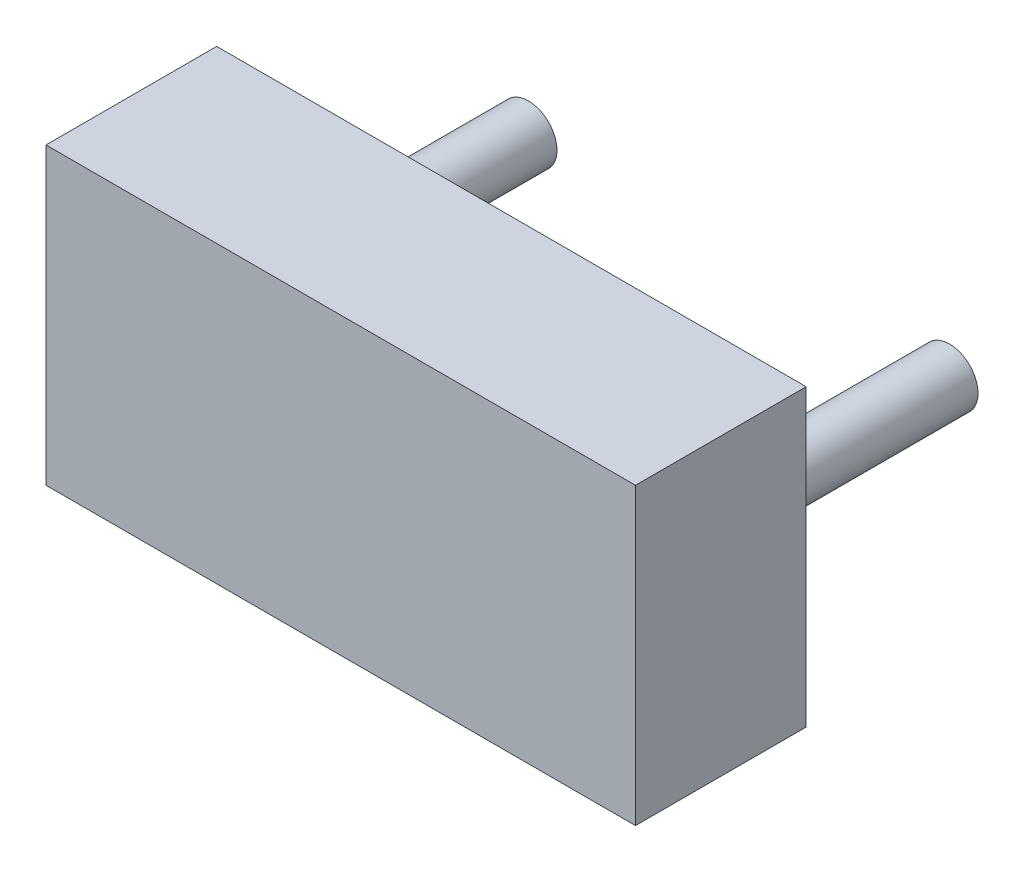
ISO-10303-21;
HEADER;
FILE_DESCRIPTION(('STEP AP214'),'2;1');
FILE_NAME('part.step','',(''),(''),'','','');
FILE_SCHEMA(('AUTOMOTIVE_DESIGN { 1 0 10303 214 1 1 1 1 }'));
ENDSEC;
DATA;
#1=APPLICATION_CONTEXT('core data for automotive mechanical design processes');
#2=APPLICATION_PROTOCOL_DEFINITION('international standard','automotive_design',2000,#1);
#3=PRODUCT_CONTEXT('',#1,'mechanical');
#4=PRODUCT('Part','Part','',(#3));
#5=PRODUCT_RELATED_PRODUCT_CATEGORY('part','',(#4));
#6=PRODUCT_DEFINITION_FORMATION('','',#4);
#7=PRODUCT_DEFINITION_CONTEXT('part definition',#1,'design');
#8=PRODUCT_DEFINITION('design','',#6,#7);
#9=PRODUCT_DEFINITION_SHAPE('','',#8);
#10=(LENGTH_UNIT() NAMED_UNIT(*) SI_UNIT(.MILLI.,.METRE.));
#11=(NAMED_UNIT(*) PLANE_ANGLE_UNIT() SI_UNIT($,.RADIAN.));
#12=(NAMED_UNIT(*) SI_UNIT($,.STERADIAN.) SOLID_ANGLE_UNIT());
#13=UNCERTAINTY_MEASURE_WITH_UNIT(LENGTH_MEASURE(1.E-05),#10,'distance_accuracy_value','');
#14=(GEOMETRIC_REPRESENTATION_CONTEXT(3) GLOBAL_UNCERTAINTY_ASSIGNED_CONTEXT((#13)) GLOBAL_UNIT_ASSIGNED_CONTEXT((#10,
#11,#12)) REPRESENTATION_CONTEXT('',''));
#15=CARTESIAN_POINT('',(0.,0.,0.));
#16=DIRECTION('',(0.,0.,1.));
#17=DIRECTION('',(1.,0.,0.));
#18=AXIS2_PLACEMENT_3D('',#15,#16,#17);
#19=CARTESIAN_POINT('',(1.85,0.,-2.));
#20=DIRECTION('',(0.,0.,1.));
#21=DIRECTION('',(1.,0.,0.));
#22=AXIS2_PLACEMENT_3D('',#19,#20,#21);
#23=CYLINDRICAL_SURFACE('',#22,0.25);
#24=CARTESIAN_POINT('',(1.85,0.,-2.));
#25=DIRECTION('',(0.,0.,1.));
#26=DIRECTION('',(1.,0.,0.));
#27=AXIS2_PLACEMENT_3D('',#24,#25,#26);
#28=CIRCLE('',#27,0.25);
#29=CARTESIAN_POINT('',(2.1,0.,-2.));
#30=VERTEX_POINT('',#29);
#31=EDGE_CURVE('E11',#30,#30,#28,.T.);
#32=ORIENTED_EDGE('',*,*,#31,.T.);
#33=EDGE_LOOP('',(#32));
#34=FACE_BOUND('',#33,.T.);
#35=CARTESIAN_POINT('',(1.85,0.,0.));
#36=DIRECTION('',(0.,0.,1.));
#37=DIRECTION('',(1.,0.,0.));
#38=AXIS2_PLACEMENT_3D('',#35,#36,#37);
#39=CIRCLE('',#38,0.25);
#40=CARTESIAN_POINT('',(2.1,0.,0.));
#41=VERTEX_POINT('',#40);
#42=EDGE_CURVE('E43',#41,#41,#39,.T.);
#43=ORIENTED_EDGE('',*,*,#42,.F.);
#44=EDGE_LOOP('',(#43));
#45=FACE_BOUND('',#44,.T.);
#46=ADVANCED_FACE('F40',(#34,#45),#23,.T.);
#47=CARTESIAN_POINT('',(1.85,0.,-2.));
#48=DIRECTION('',(0.,0.,1.));
#49=DIRECTION('',(1.,0.,0.));
#50=AXIS2_PLACEMENT_3D('',#47,#48,#49);
#51=PLANE('',#50);
#52=ORIENTED_EDGE('',*,*,#31,.F.);
#53=EDGE_LOOP('',(#52));
#54=FACE_BOUND('',#53,.T.);
#55=ADVANCED_FACE('F55',(#54),#51,.F.);
#56=CARTESIAN_POINT('',(1.85,0.,0.));
#57=DIRECTION('',(0.,0.,1.));
#58=DIRECTION('',(1.,0.,0.));
#59=AXIS2_PLACEMENT_3D('',#56,#57,#58);
#60=PLANE('',#59);
#61=ORIENTED_EDGE('',*,*,#42,.T.);
#62=EDGE_LOOP('',(#61));
#63=FACE_BOUND('',#62,.T.);
#64=ADVANCED_FACE('F52',(#63),#60,.T.);
#65=CLOSED_SHELL('',(#46,#55,#64));
#66=MANIFOLD_SOLID_BREP('B2',#65);
#67=CARTESIAN_POINT('',(-1.85,0.,-2.));
#68=DIRECTION('',(0.,0.,1.));
#69=DIRECTION('',(1.,0.,0.));
#70=AXIS2_PLACEMENT_3D('',#67,#68,#69);
#71=CYLINDRICAL_SURFACE('',#70,0.25);
#72=CARTESIAN_POINT('',(-1.85,0.,-2.));
#73=DIRECTION('',(0.,0.,1.));
#74=DIRECTION('',(1.,0.,0.));
#75=AXIS2_PLACEMENT_3D('',#72,#73,#74);
#76=CIRCLE('',#75,0.25);
#77=CARTESIAN_POINT('',(-1.6,0.,-2.));
#78=VERTEX_POINT('',#77);
#79=EDGE_CURVE('E39',#78,#78,#76,.T.);
#80=ORIENTED_EDGE('',*,*,#79,.T.);
#81=EDGE_LOOP('',(#80));
#82=FACE_BOUND('',#81,.T.);
#83=CARTESIAN_POINT('',(-1.85,0.,0.));
#84=DIRECTION('',(0.,0.,1.));
#85=DIRECTION('',(1.,0.,0.));
#86=AXIS2_PLACEMENT_3D('',#83,#84,#85);
#87=CIRCLE('',#86,0.25);
#88=CARTESIAN_POINT('',(-1.6,0.,0.));
#89=VERTEX_POINT('',#88);
#90=EDGE_CURVE('E93',#89,#89,#87,.T.);
#91=ORIENTED_EDGE('',*,*,#90,.F.);
#92=EDGE_LOOP('',(#91));
#93=FACE_BOUND('',#92,.T.);
#94=ADVANCED_FACE('F90',(#82,#93),#71,.T.);
#95=CARTESIAN_POINT('',(-1.85,0.,-2.));
#96=DIRECTION('',(0.,0.,1.));
#97=DIRECTION('',(1.,0.,0.));
#98=AXIS2_PLACEMENT_3D('',#95,#96,#97);
#99=PLANE('',#98);
#100=ORIENTED_EDGE('',*,*,#79,.F.);
#101=EDGE_LOOP('',(#100));
#102=FACE_BOUND('',#101,.T.);
#103=ADVANCED_FACE('F105',(#102),#99,.F.);
#104=CARTESIAN_POINT('',(-1.85,0.,0.));
#105=DIRECTION('',(0.,0.,1.));
#106=DIRECTION('',(1.,0.,0.));
#107=AXIS2_PLACEMENT_3D('',#104,#105,#106);
#108=PLANE('',#107);
#109=ORIENTED_EDGE('',*,*,#90,.T.);
#110=EDGE_LOOP('',(#109));
#111=FACE_BOUND('',#110,.T.);
#112=ADVANCED_FACE('F102',(#111),#108,.T.);
#113=CLOSED_SHELL('',(#94,#103,#112));
#114=MANIFOLD_SOLID_BREP('B6',#113);
#115=CARTESIAN_POINT('',(2.59,-1.295,1.5));
#116=DIRECTION('',(-1.,0.,0.));
#117=DIRECTION('',(0.,0.,1.));
#118=AXIS2_PLACEMENT_3D('',#115,#116,#117);
#119=PLANE('',#118);
#120=DIRECTION('',(0.,1.,0.));
#121=VECTOR('',#120,1.);
#122=CARTESIAN_POINT('',(2.59,-1.295,0.));
#123=LINE('',#122,#121);
#124=CARTESIAN_POINT('',(2.59,-1.295,0.));
#125=VERTEX_POINT('',#124);
#126=CARTESIAN_POINT('',(2.59,1.295,0.));
#127=VERTEX_POINT('',#126);
#128=EDGE_CURVE('E194',#125,#127,#123,.T.);
#129=ORIENTED_EDGE('',*,*,#128,.T.);
#130=DIRECTION('',(0.,0.,-1.));
#131=VECTOR('',#130,1.);
#132=CARTESIAN_POINT('',(2.59,1.295,1.5));
#133=LINE('',#132,#131);
#134=CARTESIAN_POINT('',(2.59,1.295,1.5));
#135=VERTEX_POINT('',#134);
#136=EDGE_CURVE('E88',#135,#127,#133,.T.);
#137=ORIENTED_EDGE('',*,*,#136,.F.);
#138=DIRECTION('',(0.,1.,0.));
#139=VECTOR('',#138,1.);
#140=CARTESIAN_POINT('',(2.59,-1.295,1.5));
#141=LINE('',#140,#139);
#142=CARTESIAN_POINT('',(2.59,-1.295,1.5));
#143=VERTEX_POINT('',#142);
#144=EDGE_CURVE('E182',#143,#135,#141,.T.);
#145=ORIENTED_EDGE('',*,*,#144,.F.);
#146=DIRECTION('',(0.,0.,-1.));
#147=VECTOR('',#146,1.);
#148=CARTESIAN_POINT('',(2.59,-1.295,1.5));
#149=LINE('',#148,#147);
#150=EDGE_CURVE('E190',#143,#125,#149,.T.);
#151=ORIENTED_EDGE('',*,*,#150,.T.);
#152=EDGE_LOOP('',(#129,#137,#145,#151));
#153=FACE_BOUND('',#152,.T.);
#154=ADVANCED_FACE('F131',(#153),#119,.F.);
#155=CARTESIAN_POINT('',(2.59,1.295,1.5));
#156=DIRECTION('',(0.,-1.,0.));
#157=DIRECTION('',(0.,0.,-1.));
#158=AXIS2_PLACEMENT_3D('',#155,#156,#157);
#159=PLANE('',#158);
#160=DIRECTION('',(-1.,0.,0.));
#161=VECTOR('',#160,1.);
#162=CARTESIAN_POINT('',(2.59,1.295,0.));
#163=LINE('',#162,#161);
#164=CARTESIAN_POINT('',(-2.59,1.295,0.));
#165=VERTEX_POINT('',#164);
#166=EDGE_CURVE('E186',#127,#165,#163,.T.);
#167=ORIENTED_EDGE('',*,*,#166,.T.);
#168=DIRECTION('',(0.,0.,-1.));
#169=VECTOR('',#168,1.);
#170=CARTESIAN_POINT('',(-2.59,1.295,1.5));
#171=LINE('',#170,#169);
#172=CARTESIAN_POINT('',(-2.59,1.295,1.5));
#173=VERTEX_POINT('',#172);
#174=EDGE_CURVE('E139',#173,#165,#171,.T.);
#175=ORIENTED_EDGE('',*,*,#174,.F.);
#176=DIRECTION('',(-1.,0.,0.));
#177=VECTOR('',#176,1.);
#178=CARTESIAN_POINT('',(2.59,1.295,1.5));
#179=LINE('',#178,#177);
#180=EDGE_CURVE('E177',#135,#173,#179,.T.);
#181=ORIENTED_EDGE('',*,*,#180,.F.);
#182=ORIENTED_EDGE('',*,*,#136,.T.);
#183=EDGE_LOOP('',(#167,#175,#181,#182));
#184=FACE_BOUND('',#183,.T.);
#185=ADVANCED_FACE('F185',(#184),#159,.F.);
#186=CARTESIAN_POINT('',(-2.59,1.295,1.5));
#187=DIRECTION('',(1.,0.,0.));
#188=DIRECTION('',(0.,0.,-1.));
#189=AXIS2_PLACEMENT_3D('',#186,#187,#188);
#190=PLANE('',#189);
#191=DIRECTION('',(0.,-1.,0.));
#192=VECTOR('',#191,1.);
#193=CARTESIAN_POINT('',(-2.59,1.295,0.));
#194=LINE('',#193,#192);
#195=CARTESIAN_POINT('',(-2.59,-1.295,0.));
#196=VERTEX_POINT('',#195);
#197=EDGE_CURVE('E164',#165,#196,#194,.T.);
#198=ORIENTED_EDGE('',*,*,#197,.T.);
#199=DIRECTION('',(0.,0.,-1.));
#200=VECTOR('',#199,1.);
#201=CARTESIAN_POINT('',(-2.59,-1.295,1.5));
#202=LINE('',#201,#200);
#203=CARTESIAN_POINT('',(-2.59,-1.295,1.5));
#204=VERTEX_POINT('',#203);
#205=EDGE_CURVE('E187',#204,#196,#202,.T.);
#206=ORIENTED_EDGE('',*,*,#205,.F.);
#207=DIRECTION('',(0.,-1.,0.));
#208=VECTOR('',#207,1.);
#209=CARTESIAN_POINT('',(-2.59,1.295,1.5));
#210=LINE('',#209,#208);
#211=EDGE_CURVE('E180',#173,#204,#210,.T.);
#212=ORIENTED_EDGE('',*,*,#211,.F.);
#213=ORIENTED_EDGE('',*,*,#174,.T.);
#214=EDGE_LOOP('',(#198,#206,#212,#213));
#215=FACE_BOUND('',#214,.T.);
#216=ADVANCED_FACE('F188',(#215),#190,.F.);
#217=CARTESIAN_POINT('',(-2.59,-1.295,1.5));
#218=DIRECTION('',(0.,1.,0.));
#219=DIRECTION('',(0.,0.,1.));
#220=AXIS2_PLACEMENT_3D('',#217,#218,#219);
#221=PLANE('',#220);
#222=DIRECTION('',(1.,0.,0.));
#223=VECTOR('',#222,1.);
#224=CARTESIAN_POINT('',(-2.59,-1.295,0.));
#225=LINE('',#224,#223);
#226=EDGE_CURVE('E170',#196,#125,#225,.T.);
#227=ORIENTED_EDGE('',*,*,#226,.T.);
#228=ORIENTED_EDGE('',*,*,#150,.F.);
#229=DIRECTION('',(1.,0.,0.));
#230=VECTOR('',#229,1.);
#231=CARTESIAN_POINT('',(-2.59,-1.295,1.5));
#232=LINE('',#231,#230);
#233=EDGE_CURVE('E147',#204,#143,#232,.T.);
#234=ORIENTED_EDGE('',*,*,#233,.F.);
#235=ORIENTED_EDGE('',*,*,#205,.T.);
#236=EDGE_LOOP('',(#227,#228,#234,#235));
#237=FACE_BOUND('',#236,.T.);
#238=ADVANCED_FACE('F201',(#237),#221,.F.);
#239=CARTESIAN_POINT('',(0.,0.,1.5));
#240=DIRECTION('',(0.,0.,1.));
#241=DIRECTION('',(1.,0.,0.));
#242=AXIS2_PLACEMENT_3D('',#239,#240,#241);
#243=PLANE('',#242);
#244=ORIENTED_EDGE('',*,*,#144,.T.);
#245=ORIENTED_EDGE('',*,*,#180,.T.);
#246=ORIENTED_EDGE('',*,*,#211,.T.);
#247=ORIENTED_EDGE('',*,*,#233,.T.);
#248=EDGE_LOOP('',(#244,#245,#246,#247));
#249=FACE_BOUND('',#248,.T.);
#250=ADVANCED_FACE('F178',(#249),#243,.T.);
#251=CARTESIAN_POINT('',(0.,0.,0.));
#252=DIRECTION('',(0.,0.,1.));
#253=DIRECTION('',(1.,0.,0.));
#254=AXIS2_PLACEMENT_3D('',#251,#252,#253);
#255=PLANE('',#254);
#256=ORIENTED_EDGE('',*,*,#128,.F.);
#257=ORIENTED_EDGE('',*,*,#226,.F.);
#258=ORIENTED_EDGE('',*,*,#197,.F.);
#259=ORIENTED_EDGE('',*,*,#166,.F.);
#260=EDGE_LOOP('',(#256,#257,#258,#259));
#261=FACE_BOUND('',#260,.T.);
#262=ADVANCED_FACE('F204',(#261),#255,.F.);
#263=CLOSED_SHELL('',(#154,#185,#216,#238,#250,#262));
#264=MANIFOLD_SOLID_BREP('B34',#263);
#265=ADVANCED_BREP_SHAPE_REPRESENTATION('',(#18,#66,#114,#264),#14);
#266=SHAPE_DEFINITION_REPRESENTATION(#9,#265);
ENDSEC;
END-ISO-10303-21;
